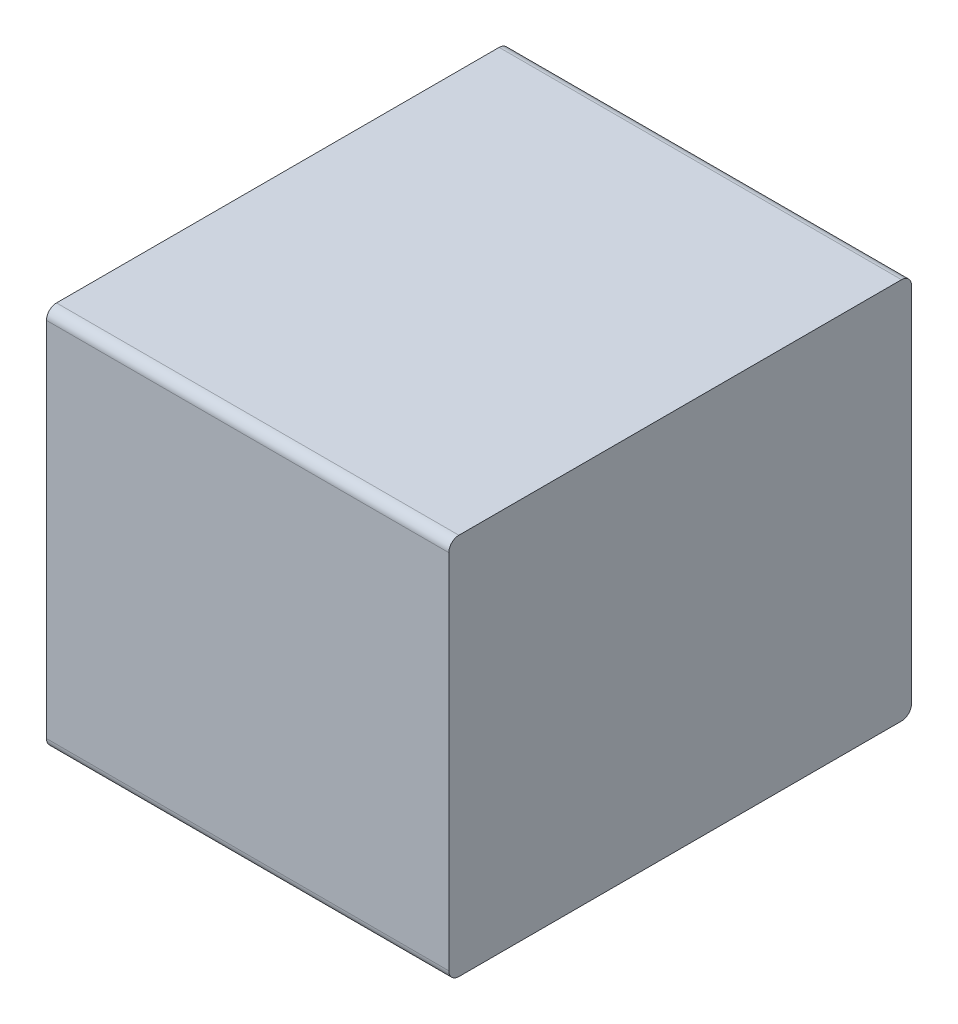
ISO-10303-21;
HEADER;
FILE_DESCRIPTION(('STEP AP214'),'2;1');
FILE_NAME('part.step','',(''),(''),'','','');
FILE_SCHEMA(('AUTOMOTIVE_DESIGN { 1 0 10303 214 1 1 1 1 }'));
ENDSEC;
DATA;
#1=APPLICATION_CONTEXT('core data for automotive mechanical design processes');
#2=APPLICATION_PROTOCOL_DEFINITION('international standard','automotive_design',2000,#1);
#3=PRODUCT_CONTEXT('',#1,'mechanical');
#4=PRODUCT('Part','Part','',(#3));
#5=PRODUCT_RELATED_PRODUCT_CATEGORY('part','',(#4));
#6=PRODUCT_DEFINITION_FORMATION('','',#4);
#7=PRODUCT_DEFINITION_CONTEXT('part definition',#1,'design');
#8=PRODUCT_DEFINITION('design','',#6,#7);
#9=PRODUCT_DEFINITION_SHAPE('','',#8);
#10=(LENGTH_UNIT() NAMED_UNIT(*) SI_UNIT(.MILLI.,.METRE.));
#11=(NAMED_UNIT(*) PLANE_ANGLE_UNIT() SI_UNIT($,.RADIAN.));
#12=(NAMED_UNIT(*) SI_UNIT($,.STERADIAN.) SOLID_ANGLE_UNIT());
#13=UNCERTAINTY_MEASURE_WITH_UNIT(LENGTH_MEASURE(1.E-05),#10,'distance_accuracy_value','');
#14=(GEOMETRIC_REPRESENTATION_CONTEXT(3) GLOBAL_UNCERTAINTY_ASSIGNED_CONTEXT((#13)) GLOBAL_UNIT_ASSIGNED_CONTEXT((#10,
#11,#12)) REPRESENTATION_CONTEXT('',''));
#15=CARTESIAN_POINT('',(0.,0.,0.));
#16=DIRECTION('',(0.,0.,1.));
#17=DIRECTION('',(1.,0.,0.));
#18=AXIS2_PLACEMENT_3D('',#15,#16,#17);
#19=CARTESIAN_POINT('',(-0.25,-0.225,0.574999999999999));
#20=DIRECTION('',(1.,0.,0.));
#21=DIRECTION('',(0.,0.,1.));
#22=AXIS2_PLACEMENT_3D('',#19,#20,#21);
#23=CYLINDRICAL_SURFACE('',#22,0.0125);
#24=CARTESIAN_POINT('',(0.25,-0.225,0.574999999999999));
#25=DIRECTION('',(1.,0.,0.));
#26=DIRECTION('',(0.,0.,1.));
#27=AXIS2_PLACEMENT_3D('',#24,#25,#26);
#28=CIRCLE('',#27,0.0125);
#29=CARTESIAN_POINT('',(0.25,-0.225,0.587499999999999));
#30=VERTEX_POINT('',#29);
#31=CARTESIAN_POINT('',(0.25,-0.2375,0.574999999999999));
#32=VERTEX_POINT('',#31);
#33=EDGE_CURVE('E11',#30,#32,#28,.T.);
#34=ORIENTED_EDGE('',*,*,#33,.F.);
#35=DIRECTION('',(1.,0.,0.));
#36=VECTOR('',#35,1.);
#37=CARTESIAN_POINT('',(-0.25,-0.225,0.587499999999999));
#38=LINE('',#37,#36);
#39=CARTESIAN_POINT('',(-0.25,-0.225,0.587499999999999));
#40=VERTEX_POINT('',#39);
#41=EDGE_CURVE('E24',#40,#30,#38,.T.);
#42=ORIENTED_EDGE('',*,*,#41,.F.);
#43=CARTESIAN_POINT('',(-0.25,-0.225,0.574999999999999));
#44=DIRECTION('',(-1.,0.,0.));
#45=DIRECTION('',(0.,0.,1.));
#46=AXIS2_PLACEMENT_3D('',#43,#44,#45);
#47=CIRCLE('',#46,0.0125);
#48=CARTESIAN_POINT('',(-0.25,-0.2375,0.574999999999999));
#49=VERTEX_POINT('',#48);
#50=EDGE_CURVE('E146',#49,#40,#47,.T.);
#51=ORIENTED_EDGE('',*,*,#50,.F.);
#52=DIRECTION('',(1.,0.,0.));
#53=VECTOR('',#52,1.);
#54=CARTESIAN_POINT('',(-0.25,-0.2375,0.574999999999999));
#55=LINE('',#54,#53);
#56=EDGE_CURVE('E144',#49,#32,#55,.T.);
#57=ORIENTED_EDGE('',*,*,#56,.T.);
#58=EDGE_LOOP('',(#34,#42,#51,#57));
#59=FACE_BOUND('',#58,.T.);
#60=ADVANCED_FACE('F17',(#59),#23,.T.);
#61=CARTESIAN_POINT('',(-0.25,-0.225,0.0125));
#62=DIRECTION('',(0.,0.,-1.));
#63=DIRECTION('',(0.,1.,0.));
#64=AXIS2_PLACEMENT_3D('',#61,#62,#63);
#65=PLANE('',#64);
#66=DIRECTION('',(0.,1.,0.));
#67=VECTOR('',#66,1.);
#68=CARTESIAN_POINT('',(0.25,0.0125000000000001,0.0125));
#69=LINE('',#68,#67);
#70=CARTESIAN_POINT('',(0.25,-0.225,0.0125));
#71=VERTEX_POINT('',#70);
#72=CARTESIAN_POINT('',(0.25,0.225,0.0125000000000001));
#73=VERTEX_POINT('',#72);
#74=EDGE_CURVE('E142',#71,#73,#69,.T.);
#75=ORIENTED_EDGE('',*,*,#74,.F.);
#76=DIRECTION('',(1.,0.,0.));
#77=VECTOR('',#76,1.);
#78=CARTESIAN_POINT('',(-0.25,-0.225,0.0125));
#79=LINE('',#78,#77);
#80=CARTESIAN_POINT('',(-0.25,-0.225,0.0125));
#81=VERTEX_POINT('',#80);
#82=EDGE_CURVE('E139',#81,#71,#79,.T.);
#83=ORIENTED_EDGE('',*,*,#82,.F.);
#84=DIRECTION('',(0.,-1.,0.));
#85=VECTOR('',#84,1.);
#86=CARTESIAN_POINT('',(-0.25,-0.2375,0.0125));
#87=LINE('',#86,#85);
#88=CARTESIAN_POINT('',(-0.25,0.225,0.0125000000000001));
#89=VERTEX_POINT('',#88);
#90=EDGE_CURVE('E137',#89,#81,#87,.T.);
#91=ORIENTED_EDGE('',*,*,#90,.F.);
#92=DIRECTION('',(1.,0.,0.));
#93=VECTOR('',#92,1.);
#94=CARTESIAN_POINT('',(-0.25,0.225,0.0125000000000001));
#95=LINE('',#94,#93);
#96=EDGE_CURVE('E104',#89,#73,#95,.T.);
#97=ORIENTED_EDGE('',*,*,#96,.T.);
#98=EDGE_LOOP('',(#75,#83,#91,#97));
#99=FACE_BOUND('',#98,.T.);
#100=ADVANCED_FACE('F163',(#99),#65,.T.);
#101=CARTESIAN_POINT('',(-0.25,-0.2375,0.574999999999999));
#102=DIRECTION('',(0.,-1.,0.));
#103=DIRECTION('',(0.,0.,-1.));
#104=AXIS2_PLACEMENT_3D('',#101,#102,#103);
#105=PLANE('',#104);
#106=DIRECTION('',(0.,0.,-1.));
#107=VECTOR('',#106,1.);
#108=CARTESIAN_POINT('',(0.25,-0.2375,0.287500000000001));
#109=LINE('',#108,#107);
#110=CARTESIAN_POINT('',(0.25,-0.2375,0.025));
#111=VERTEX_POINT('',#110);
#112=EDGE_CURVE('E134',#32,#111,#109,.T.);
#113=ORIENTED_EDGE('',*,*,#112,.F.);
#114=ORIENTED_EDGE('',*,*,#56,.F.);
#115=DIRECTION('',(0.,0.,1.));
#116=VECTOR('',#115,1.);
#117=CARTESIAN_POINT('',(-0.25,-0.2375,0.287500000000001));
#118=LINE('',#117,#116);
#119=CARTESIAN_POINT('',(-0.25,-0.2375,0.025));
#120=VERTEX_POINT('',#119);
#121=EDGE_CURVE('E131',#120,#49,#118,.T.);
#122=ORIENTED_EDGE('',*,*,#121,.F.);
#123=DIRECTION('',(1.,0.,0.));
#124=VECTOR('',#123,1.);
#125=CARTESIAN_POINT('',(-0.25,-0.2375,0.025));
#126=LINE('',#125,#124);
#127=EDGE_CURVE('E128',#120,#111,#126,.T.);
#128=ORIENTED_EDGE('',*,*,#127,.T.);
#129=EDGE_LOOP('',(#113,#114,#122,#128));
#130=FACE_BOUND('',#129,.T.);
#131=ADVANCED_FACE('F156',(#130),#105,.T.);
#132=CARTESIAN_POINT('',(-0.25,-0.225,0.025));
#133=DIRECTION('',(1.,0.,0.));
#134=DIRECTION('',(0.,-1.,0.));
#135=AXIS2_PLACEMENT_3D('',#132,#133,#134);
#136=CYLINDRICAL_SURFACE('',#135,0.0125);
#137=CARTESIAN_POINT('',(0.25,-0.225,0.025));
#138=DIRECTION('',(1.,0.,0.));
#139=DIRECTION('',(0.,-1.,0.));
#140=AXIS2_PLACEMENT_3D('',#137,#138,#139);
#141=CIRCLE('',#140,0.0125);
#142=EDGE_CURVE('E125',#111,#71,#141,.T.);
#143=ORIENTED_EDGE('',*,*,#142,.F.);
#144=ORIENTED_EDGE('',*,*,#127,.F.);
#145=CARTESIAN_POINT('',(-0.25,-0.225,0.025));
#146=DIRECTION('',(-1.,0.,0.));
#147=DIRECTION('',(0.,-1.,0.));
#148=AXIS2_PLACEMENT_3D('',#145,#146,#147);
#149=CIRCLE('',#148,0.0125);
#150=EDGE_CURVE('E122',#81,#120,#149,.T.);
#151=ORIENTED_EDGE('',*,*,#150,.F.);
#152=ORIENTED_EDGE('',*,*,#82,.T.);
#153=EDGE_LOOP('',(#143,#144,#151,#152));
#154=FACE_BOUND('',#153,.T.);
#155=ADVANCED_FACE('F160',(#154),#136,.T.);
#156=CARTESIAN_POINT('',(-0.25,0.225,0.587499999999999));
#157=DIRECTION('',(0.,0.,1.));
#158=DIRECTION('',(0.,-1.,0.));
#159=AXIS2_PLACEMENT_3D('',#156,#157,#158);
#160=PLANE('',#159);
#161=DIRECTION('',(0.,-1.,0.));
#162=VECTOR('',#161,1.);
#163=CARTESIAN_POINT('',(0.25,0.2375,0.587499999999999));
#164=LINE('',#163,#162);
#165=CARTESIAN_POINT('',(0.25,0.225,0.587499999999999));
#166=VERTEX_POINT('',#165);
#167=EDGE_CURVE('E120',#166,#30,#164,.T.);
#168=ORIENTED_EDGE('',*,*,#167,.F.);
#169=DIRECTION('',(1.,0.,0.));
#170=VECTOR('',#169,1.);
#171=CARTESIAN_POINT('',(-0.25,0.225,0.587499999999999));
#172=LINE('',#171,#170);
#173=CARTESIAN_POINT('',(-0.25,0.225,0.587499999999999));
#174=VERTEX_POINT('',#173);
#175=EDGE_CURVE('E117',#174,#166,#172,.T.);
#176=ORIENTED_EDGE('',*,*,#175,.F.);
#177=DIRECTION('',(0.,1.,0.));
#178=VECTOR('',#177,1.);
#179=CARTESIAN_POINT('',(-0.25,-0.0125,0.587499999999999));
#180=LINE('',#179,#178);
#181=EDGE_CURVE('E115',#40,#174,#180,.T.);
#182=ORIENTED_EDGE('',*,*,#181,.F.);
#183=ORIENTED_EDGE('',*,*,#41,.T.);
#184=EDGE_LOOP('',(#168,#176,#182,#183));
#185=FACE_BOUND('',#184,.T.);
#186=ADVANCED_FACE('F149',(#185),#160,.T.);
#187=CARTESIAN_POINT('',(-0.25,0.225,0.574999999999999));
#188=DIRECTION('',(1.,0.,0.));
#189=DIRECTION('',(0.,1.,0.));
#190=AXIS2_PLACEMENT_3D('',#187,#188,#189);
#191=CYLINDRICAL_SURFACE('',#190,0.0125);
#192=CARTESIAN_POINT('',(0.25,0.225,0.574999999999999));
#193=DIRECTION('',(1.,0.,0.));
#194=DIRECTION('',(0.,1.,0.));
#195=AXIS2_PLACEMENT_3D('',#192,#193,#194);
#196=CIRCLE('',#195,0.0125);
#197=CARTESIAN_POINT('',(0.25,0.2375,0.574999999999999));
#198=VERTEX_POINT('',#197);
#199=EDGE_CURVE('E112',#198,#166,#196,.T.);
#200=ORIENTED_EDGE('',*,*,#199,.F.);
#201=DIRECTION('',(1.,0.,0.));
#202=VECTOR('',#201,1.);
#203=CARTESIAN_POINT('',(-0.25,0.2375,0.574999999999999));
#204=LINE('',#203,#202);
#205=CARTESIAN_POINT('',(-0.25,0.2375,0.574999999999999));
#206=VERTEX_POINT('',#205);
#207=EDGE_CURVE('E110',#206,#198,#204,.T.);
#208=ORIENTED_EDGE('',*,*,#207,.F.);
#209=CARTESIAN_POINT('',(-0.25,0.225,0.574999999999999));
#210=DIRECTION('',(-1.,0.,0.));
#211=DIRECTION('',(0.,1.,0.));
#212=AXIS2_PLACEMENT_3D('',#209,#210,#211);
#213=CIRCLE('',#212,0.0125);
#214=EDGE_CURVE('E98',#174,#206,#213,.T.);
#215=ORIENTED_EDGE('',*,*,#214,.F.);
#216=ORIENTED_EDGE('',*,*,#175,.T.);
#217=EDGE_LOOP('',(#200,#208,#215,#216));
#218=FACE_BOUND('',#217,.T.);
#219=ADVANCED_FACE('F152',(#218),#191,.T.);
#220=CARTESIAN_POINT('',(-0.25,0.2375,0.0250000000000001));
#221=DIRECTION('',(0.,1.,0.));
#222=DIRECTION('',(0.,0.,1.));
#223=AXIS2_PLACEMENT_3D('',#220,#221,#222);
#224=PLANE('',#223);
#225=DIRECTION('',(0.,0.,1.));
#226=VECTOR('',#225,1.);
#227=CARTESIAN_POINT('',(0.25,0.2375,0.0125));
#228=LINE('',#227,#226);
#229=CARTESIAN_POINT('',(0.25,0.2375,0.0250000000000001));
#230=VERTEX_POINT('',#229);
#231=EDGE_CURVE('E83',#230,#198,#228,.T.);
#232=ORIENTED_EDGE('',*,*,#231,.F.);
#233=DIRECTION('',(1.,0.,0.));
#234=VECTOR('',#233,1.);
#235=CARTESIAN_POINT('',(-0.25,0.2375,0.0250000000000001));
#236=LINE('',#235,#234);
#237=CARTESIAN_POINT('',(-0.25,0.2375,0.0250000000000001));
#238=VERTEX_POINT('',#237);
#239=EDGE_CURVE('E77',#238,#230,#236,.T.);
#240=ORIENTED_EDGE('',*,*,#239,.F.);
#241=DIRECTION('',(0.,0.,-1.));
#242=VECTOR('',#241,1.);
#243=CARTESIAN_POINT('',(-0.25,0.2375,0.0125000000000001));
#244=LINE('',#243,#242);
#245=EDGE_CURVE('E81',#206,#238,#244,.T.);
#246=ORIENTED_EDGE('',*,*,#245,.F.);
#247=ORIENTED_EDGE('',*,*,#207,.T.);
#248=EDGE_LOOP('',(#232,#240,#246,#247));
#249=FACE_BOUND('',#248,.T.);
#250=ADVANCED_FACE('F79',(#249),#224,.T.);
#251=CARTESIAN_POINT('',(-0.25,0.225,0.0250000000000001));
#252=DIRECTION('',(1.,0.,0.));
#253=DIRECTION('',(0.,0.,-1.));
#254=AXIS2_PLACEMENT_3D('',#251,#252,#253);
#255=CYLINDRICAL_SURFACE('',#254,0.0125);
#256=CARTESIAN_POINT('',(0.25,0.225,0.0250000000000001));
#257=DIRECTION('',(1.,0.,0.));
#258=DIRECTION('',(0.,0.,-1.));
#259=AXIS2_PLACEMENT_3D('',#256,#257,#258);
#260=CIRCLE('',#259,0.0125);
#261=EDGE_CURVE('E99',#73,#230,#260,.T.);
#262=ORIENTED_EDGE('',*,*,#261,.F.);
#263=ORIENTED_EDGE('',*,*,#96,.F.);
#264=CARTESIAN_POINT('',(-0.25,0.225,0.0250000000000001));
#265=DIRECTION('',(-1.,0.,0.));
#266=DIRECTION('',(0.,0.,-1.));
#267=AXIS2_PLACEMENT_3D('',#264,#265,#266);
#268=CIRCLE('',#267,0.0125);
#269=EDGE_CURVE('E95',#238,#89,#268,.T.);
#270=ORIENTED_EDGE('',*,*,#269,.F.);
#271=ORIENTED_EDGE('',*,*,#239,.T.);
#272=EDGE_LOOP('',(#262,#263,#270,#271));
#273=FACE_BOUND('',#272,.T.);
#274=ADVANCED_FACE('F102',(#273),#255,.T.);
#275=CARTESIAN_POINT('',(-0.25,-0.25,0.));
#276=DIRECTION('',(1.,0.,0.));
#277=DIRECTION('',(0.,1.,0.));
#278=AXIS2_PLACEMENT_3D('',#275,#276,#277);
#279=PLANE('',#278);
#280=ORIENTED_EDGE('',*,*,#50,.T.);
#281=ORIENTED_EDGE('',*,*,#181,.T.);
#282=ORIENTED_EDGE('',*,*,#214,.T.);
#283=ORIENTED_EDGE('',*,*,#245,.T.);
#284=ORIENTED_EDGE('',*,*,#269,.T.);
#285=ORIENTED_EDGE('',*,*,#90,.T.);
#286=ORIENTED_EDGE('',*,*,#150,.T.);
#287=ORIENTED_EDGE('',*,*,#121,.T.);
#288=EDGE_LOOP('',(#280,#281,#282,#283,#284,#285,#286,#287));
#289=FACE_BOUND('',#288,.T.);
#290=ADVANCED_FACE('F93',(#289),#279,.F.);
#291=CARTESIAN_POINT('',(0.25,0.25,0.));
#292=DIRECTION('',(-1.,0.,0.));
#293=DIRECTION('',(0.,-1.,0.));
#294=AXIS2_PLACEMENT_3D('',#291,#292,#293);
#295=PLANE('',#294);
#296=ORIENTED_EDGE('',*,*,#33,.T.);
#297=ORIENTED_EDGE('',*,*,#112,.T.);
#298=ORIENTED_EDGE('',*,*,#142,.T.);
#299=ORIENTED_EDGE('',*,*,#74,.T.);
#300=ORIENTED_EDGE('',*,*,#261,.T.);
#301=ORIENTED_EDGE('',*,*,#231,.T.);
#302=ORIENTED_EDGE('',*,*,#199,.T.);
#303=ORIENTED_EDGE('',*,*,#167,.T.);
#304=EDGE_LOOP('',(#296,#297,#298,#299,#300,#301,#302,#303));
#305=FACE_BOUND('',#304,.T.);
#306=ADVANCED_FACE('F150',(#305),#295,.F.);
#307=CLOSED_SHELL('',(#60,#100,#131,#155,#186,#219,#250,#274,#290,#306));
#308=MANIFOLD_SOLID_BREP('B1',#307);
#309=ADVANCED_BREP_SHAPE_REPRESENTATION('',(#18,#308),#14);
#310=SHAPE_DEFINITION_REPRESENTATION(#9,#309);
ENDSEC;
END-ISO-10303-21;
